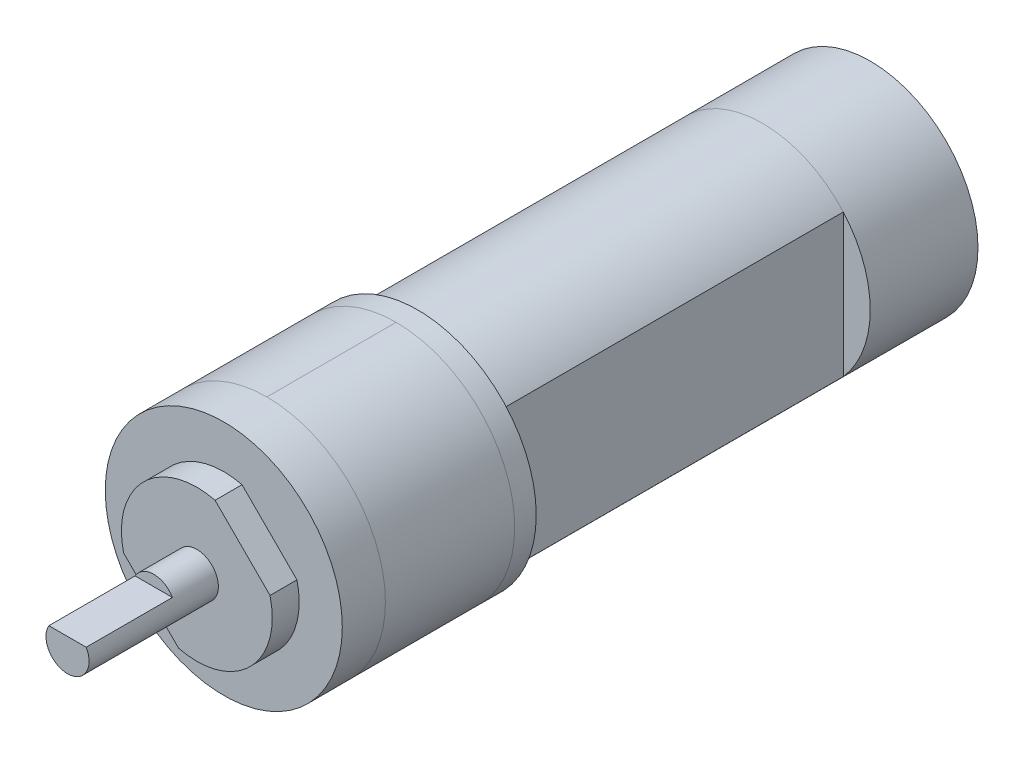
ISO-10303-21;
HEADER;
FILE_DESCRIPTION(('STEP AP214'),'2;1');
FILE_NAME('part.step','',(''),(''),'','','');
FILE_SCHEMA(('AUTOMOTIVE_DESIGN { 1 0 10303 214 1 1 1 1 }'));
ENDSEC;
DATA;
#1=APPLICATION_CONTEXT('core data for automotive mechanical design processes');
#2=APPLICATION_PROTOCOL_DEFINITION('international standard','automotive_design',2000,#1);
#3=PRODUCT_CONTEXT('',#1,'mechanical');
#4=PRODUCT('Part','Part','',(#3));
#5=PRODUCT_RELATED_PRODUCT_CATEGORY('part','',(#4));
#6=PRODUCT_DEFINITION_FORMATION('','',#4);
#7=PRODUCT_DEFINITION_CONTEXT('part definition',#1,'design');
#8=PRODUCT_DEFINITION('design','',#6,#7);
#9=PRODUCT_DEFINITION_SHAPE('','',#8);
#10=(LENGTH_UNIT() NAMED_UNIT(*) SI_UNIT(.MILLI.,.METRE.));
#11=(NAMED_UNIT(*) PLANE_ANGLE_UNIT() SI_UNIT($,.RADIAN.));
#12=(NAMED_UNIT(*) SI_UNIT($,.STERADIAN.) SOLID_ANGLE_UNIT());
#13=UNCERTAINTY_MEASURE_WITH_UNIT(LENGTH_MEASURE(1.E-05),#10,'distance_accuracy_value','');
#14=(GEOMETRIC_REPRESENTATION_CONTEXT(3) GLOBAL_UNCERTAINTY_ASSIGNED_CONTEXT((#13)) GLOBAL_UNIT_ASSIGNED_CONTEXT((#10,
#11,#12)) REPRESENTATION_CONTEXT('',''));
#15=CARTESIAN_POINT('',(0.,0.,0.));
#16=DIRECTION('',(0.,0.,1.));
#17=DIRECTION('',(1.,0.,0.));
#18=AXIS2_PLACEMENT_3D('',#15,#16,#17);
#19=CARTESIAN_POINT('',(0.,0.,51.2955465587045));
#20=DIRECTION('',(0.,0.,1.));
#21=DIRECTION('',(1.,0.,0.));
#22=AXIS2_PLACEMENT_3D('',#19,#20,#21);
#23=CYLINDRICAL_SURFACE('',#22,10.);
#24=CARTESIAN_POINT('',(0.,0.,-32.));
#25=DIRECTION('',(0.,0.,-1.));
#26=DIRECTION('',(-1.,0.,0.));
#27=AXIS2_PLACEMENT_3D('',#24,#25,#26);
#28=CIRCLE('',#27,10.);
#29=CARTESIAN_POINT('',(-7.5,-6.61437827766148,-32.));
#30=VERTEX_POINT('',#29);
#31=CARTESIAN_POINT('',(0.,-10.,-32.));
#32=VERTEX_POINT('',#31);
#33=EDGE_CURVE('E54',#30,#32,#28,.F.);
#34=ORIENTED_EDGE('',*,*,#33,.T.);
#35=CARTESIAN_POINT('',(7.5,-6.61437827766148,-32.));
#36=VERTEX_POINT('',#35);
#37=EDGE_CURVE('E12',#32,#36,#28,.F.);
#38=ORIENTED_EDGE('',*,*,#37,.T.);
#39=DIRECTION('',(0.,0.,1.));
#40=VECTOR('',#39,1.);
#41=CARTESIAN_POINT('',(7.5,-6.61437827766148,51.2955465587045));
#42=LINE('',#41,#40);
#43=CARTESIAN_POINT('',(7.5,-6.61437827766148,0.));
#44=VERTEX_POINT('',#43);
#45=EDGE_CURVE('E184',#36,#44,#42,.T.);
#46=ORIENTED_EDGE('',*,*,#45,.T.);
#47=CARTESIAN_POINT('',(0.,0.,0.));
#48=DIRECTION('',(0.,0.,1.));
#49=DIRECTION('',(1.,0.,0.));
#50=AXIS2_PLACEMENT_3D('',#47,#48,#49);
#51=CIRCLE('',#50,10.);
#52=CARTESIAN_POINT('',(-7.5,-6.61437827766148,0.));
#53=VERTEX_POINT('',#52);
#54=EDGE_CURVE('E213',#53,#44,#51,.T.);
#55=ORIENTED_EDGE('',*,*,#54,.F.);
#56=DIRECTION('',(0.,0.,1.));
#57=VECTOR('',#56,1.);
#58=CARTESIAN_POINT('',(-7.5,-6.61437827766148,51.2955465587045));
#59=LINE('',#58,#57);
#60=EDGE_CURVE('E196',#53,#30,#59,.F.);
#61=ORIENTED_EDGE('',*,*,#60,.T.);
#62=EDGE_LOOP('',(#34,#38,#46,#55,#61));
#63=FACE_BOUND('',#62,.T.);
#64=ADVANCED_FACE('F44',(#63),#23,.T.);
#65=DIRECTION('',(0.,0.,1.));
#66=VECTOR('',#65,1.);
#67=CARTESIAN_POINT('',(7.5,6.61437827766148,51.2955465587045));
#68=LINE('',#67,#66);
#69=CARTESIAN_POINT('',(7.5,6.61437827766148,0.));
#70=VERTEX_POINT('',#69);
#71=CARTESIAN_POINT('',(7.5,6.61437827766148,-32.));
#72=VERTEX_POINT('',#71);
#73=EDGE_CURVE('E191',#70,#72,#68,.F.);
#74=ORIENTED_EDGE('',*,*,#73,.T.);
#75=CARTESIAN_POINT('',(0.,10.,-32.));
#76=VERTEX_POINT('',#75);
#77=EDGE_CURVE('E67',#72,#76,#28,.F.);
#78=ORIENTED_EDGE('',*,*,#77,.T.);
#79=CARTESIAN_POINT('',(-7.5,6.61437827766148,-32.));
#80=VERTEX_POINT('',#79);
#81=EDGE_CURVE('E48',#76,#80,#28,.F.);
#82=ORIENTED_EDGE('',*,*,#81,.T.);
#83=DIRECTION('',(0.,0.,1.));
#84=VECTOR('',#83,1.);
#85=CARTESIAN_POINT('',(-7.5,6.61437827766148,51.2955465587045));
#86=LINE('',#85,#84);
#87=CARTESIAN_POINT('',(-7.5,6.61437827766148,0.));
#88=VERTEX_POINT('',#87);
#89=EDGE_CURVE('E193',#80,#88,#86,.T.);
#90=ORIENTED_EDGE('',*,*,#89,.T.);
#91=EDGE_CURVE('E214',#70,#88,#51,.T.);
#92=ORIENTED_EDGE('',*,*,#91,.F.);
#93=EDGE_LOOP('',(#74,#78,#82,#90,#92));
#94=FACE_BOUND('',#93,.T.);
#95=ADVANCED_FACE('F296',(#94),#23,.T.);
#96=CARTESIAN_POINT('',(0.,0.,51.2955465587045));
#97=DIRECTION('',(0.,0.,1.));
#98=DIRECTION('',(1.,0.,0.));
#99=AXIS2_PLACEMENT_3D('',#96,#97,#98);
#100=CYLINDRICAL_SURFACE('',#99,11.);
#101=DIRECTION('',(0.,0.,1.));
#102=VECTOR('',#101,1.);
#103=CARTESIAN_POINT('',(0.,-11.,51.2955465587045));
#104=LINE('',#103,#102);
#105=CARTESIAN_POINT('',(0.,-11.,2.));
#106=VERTEX_POINT('',#105);
#107=CARTESIAN_POINT('',(0.,-11.,14.));
#108=VERTEX_POINT('',#107);
#109=EDGE_CURVE('E251',#106,#108,#104,.T.);
#110=ORIENTED_EDGE('',*,*,#109,.F.);
#111=CARTESIAN_POINT('',(0.,0.,2.));
#112=DIRECTION('',(0.,0.,1.));
#113=DIRECTION('',(0.,-1.,0.));
#114=AXIS2_PLACEMENT_3D('',#111,#112,#113);
#115=CIRCLE('',#114,11.);
#116=CARTESIAN_POINT('',(0.,11.,2.));
#117=VERTEX_POINT('',#116);
#118=EDGE_CURVE('E246',#106,#117,#115,.T.);
#119=ORIENTED_EDGE('',*,*,#118,.T.);
#120=DIRECTION('',(0.,0.,1.));
#121=VECTOR('',#120,1.);
#122=CARTESIAN_POINT('',(0.,11.,51.2955465587045));
#123=LINE('',#122,#121);
#124=CARTESIAN_POINT('',(0.,11.,14.));
#125=VERTEX_POINT('',#124);
#126=EDGE_CURVE('E238',#117,#125,#123,.T.);
#127=ORIENTED_EDGE('',*,*,#126,.T.);
#128=CARTESIAN_POINT('',(0.,0.,14.));
#129=DIRECTION('',(0.,0.,-1.));
#130=DIRECTION('',(0.,1.,0.));
#131=AXIS2_PLACEMENT_3D('',#128,#129,#130);
#132=CIRCLE('',#131,11.);
#133=EDGE_CURVE('E250',#125,#108,#132,.T.);
#134=ORIENTED_EDGE('',*,*,#133,.T.);
#135=EDGE_LOOP('',(#110,#119,#127,#134));
#136=FACE_BOUND('',#135,.T.);
#137=ADVANCED_FACE('F264',(#136),#100,.T.);
#138=CARTESIAN_POINT('',(0.,0.,18.));
#139=DIRECTION('',(0.,0.,1.));
#140=DIRECTION('',(1.,0.,0.));
#141=AXIS2_PLACEMENT_3D('',#138,#139,#140);
#142=CIRCLE('',#141,11.);
#143=CARTESIAN_POINT('',(11.,0.,18.));
#144=VERTEX_POINT('',#143);
#145=EDGE_CURVE('E207',#144,#144,#142,.T.);
#146=ORIENTED_EDGE('',*,*,#145,.F.);
#147=EDGE_LOOP('',(#146));
#148=FACE_BOUND('',#147,.T.);
#149=ORIENTED_EDGE('',*,*,#133,.F.);
#150=EDGE_CURVE('E247',#108,#125,#132,.T.);
#151=ORIENTED_EDGE('',*,*,#150,.F.);
#152=EDGE_LOOP('',(#149,#151));
#153=FACE_BOUND('',#152,.T.);
#154=ADVANCED_FACE('F268',(#148,#153),#100,.T.);
#155=CARTESIAN_POINT('',(0.,0.,0.));
#156=DIRECTION('',(0.,0.,1.));
#157=DIRECTION('',(1.,0.,0.));
#158=AXIS2_PLACEMENT_3D('',#155,#156,#157);
#159=CIRCLE('',#158,11.);
#160=CARTESIAN_POINT('',(11.,0.,0.));
#161=VERTEX_POINT('',#160);
#162=EDGE_CURVE('E210',#161,#161,#159,.T.);
#163=ORIENTED_EDGE('',*,*,#162,.T.);
#164=EDGE_LOOP('',(#163));
#165=FACE_BOUND('',#164,.T.);
#166=ORIENTED_EDGE('',*,*,#118,.F.);
#167=EDGE_CURVE('E242',#117,#106,#115,.T.);
#168=ORIENTED_EDGE('',*,*,#167,.F.);
#169=EDGE_LOOP('',(#166,#168));
#170=FACE_BOUND('',#169,.T.);
#171=ADVANCED_FACE('F272',(#165,#170),#100,.T.);
#172=CARTESIAN_POINT('',(0.,0.,51.2955465587045));
#173=DIRECTION('',(0.,0.,1.));
#174=DIRECTION('',(1.,0.,0.));
#175=AXIS2_PLACEMENT_3D('',#172,#173,#174);
#176=CYLINDRICAL_SURFACE('',#175,7.);
#177=CARTESIAN_POINT('',(0.,0.,18.));
#178=DIRECTION('',(0.,0.,1.));
#179=DIRECTION('',(1.,0.,0.));
#180=AXIS2_PLACEMENT_3D('',#177,#178,#179);
#181=CIRCLE('',#180,7.);
#182=CARTESIAN_POINT('',(-1.69313093032293,-6.79215044391567,18.));
#183=VERTEX_POINT('',#182);
#184=CARTESIAN_POINT('',(6.79215044391569,1.69313093032286,18.));
#185=VERTEX_POINT('',#184);
#186=EDGE_CURVE('E203',#183,#185,#181,.T.);
#187=ORIENTED_EDGE('',*,*,#186,.T.);
#188=DIRECTION('',(0.,0.,1.));
#189=VECTOR('',#188,1.);
#190=CARTESIAN_POINT('',(6.79215044391569,1.69313093032286,51.2955465587045));
#191=LINE('',#190,#189);
#192=CARTESIAN_POINT('',(6.79215044391569,1.69313093032286,20.5));
#193=VERTEX_POINT('',#192);
#194=EDGE_CURVE('E167',#185,#193,#191,.T.);
#195=ORIENTED_EDGE('',*,*,#194,.T.);
#196=CARTESIAN_POINT('',(0.,0.,20.5));
#197=DIRECTION('',(0.,0.,1.));
#198=DIRECTION('',(1.,0.,0.));
#199=AXIS2_PLACEMENT_3D('',#196,#197,#198);
#200=CIRCLE('',#199,7.);
#201=CARTESIAN_POINT('',(-1.69313093032293,-6.79215044391567,20.5));
#202=VERTEX_POINT('',#201);
#203=EDGE_CURVE('E199',#202,#193,#200,.T.);
#204=ORIENTED_EDGE('',*,*,#203,.F.);
#205=DIRECTION('',(0.,0.,1.));
#206=VECTOR('',#205,1.);
#207=CARTESIAN_POINT('',(-1.69313093032293,-6.79215044391567,51.2955465587045));
#208=LINE('',#207,#206);
#209=EDGE_CURVE('E226',#202,#183,#208,.F.);
#210=ORIENTED_EDGE('',*,*,#209,.T.);
#211=EDGE_LOOP('',(#187,#195,#204,#210));
#212=FACE_BOUND('',#211,.T.);
#213=ADVANCED_FACE('F278',(#212),#176,.T.);
#214=ORIENTED_EDGE('',*,*,#37,.F.);
#215=ORIENTED_EDGE('',*,*,#33,.F.);
#216=CARTESIAN_POINT('',(0.,0.,-32.));
#217=DIRECTION('',(0.,0.,-1.));
#218=DIRECTION('',(-1.,0.,0.));
#219=AXIS2_PLACEMENT_3D('',#216,#217,#218);
#220=CIRCLE('',#219,10.);
#221=EDGE_CURVE('E223',#80,#30,#220,.F.);
#222=ORIENTED_EDGE('',*,*,#221,.F.);
#223=ORIENTED_EDGE('',*,*,#81,.F.);
#224=ORIENTED_EDGE('',*,*,#77,.F.);
#225=CARTESIAN_POINT('',(0.,0.,-32.));
#226=DIRECTION('',(0.,0.,-1.));
#227=DIRECTION('',(-1.,0.,0.));
#228=AXIS2_PLACEMENT_3D('',#225,#226,#227);
#229=CIRCLE('',#228,10.);
#230=EDGE_CURVE('E220',#36,#72,#229,.F.);
#231=ORIENTED_EDGE('',*,*,#230,.F.);
#232=EDGE_LOOP('',(#214,#215,#222,#223,#224,#231));
#233=FACE_BOUND('',#232,.T.);
#234=CARTESIAN_POINT('',(0.,0.,-42.));
#235=DIRECTION('',(0.,0.,1.));
#236=DIRECTION('',(1.,0.,0.));
#237=AXIS2_PLACEMENT_3D('',#234,#235,#236);
#238=CIRCLE('',#237,10.);
#239=CARTESIAN_POINT('',(10.,0.,-42.));
#240=VERTEX_POINT('',#239);
#241=EDGE_CURVE('E217',#240,#240,#238,.T.);
#242=ORIENTED_EDGE('',*,*,#241,.T.);
#243=EDGE_LOOP('',(#242));
#244=FACE_BOUND('',#243,.T.);
#245=ADVANCED_FACE('F285',(#233,#244),#23,.T.);
#246=CARTESIAN_POINT('',(0.,0.,20.5));
#247=DIRECTION('',(0.,0.,-1.));
#248=DIRECTION('',(-1.,0.,0.));
#249=AXIS2_PLACEMENT_3D('',#246,#247,#248);
#250=PLANE('',#249);
#251=CARTESIAN_POINT('',(0.,0.,20.5));
#252=DIRECTION('',(0.,0.,1.));
#253=DIRECTION('',(1.,0.,0.));
#254=AXIS2_PLACEMENT_3D('',#251,#252,#253);
#255=CIRCLE('',#254,2.);
#256=CARTESIAN_POINT('',(2.,0.,20.5));
#257=VERTEX_POINT('',#256);
#258=EDGE_CURVE('E150',#257,#257,#255,.T.);
#259=ORIENTED_EDGE('',*,*,#258,.F.);
#260=EDGE_LOOP('',(#259));
#261=FACE_BOUND('',#260,.T.);
#262=ORIENTED_EDGE('',*,*,#203,.T.);
#263=DIRECTION('',(0.707106781186544,-0.707106781186551,0.));
#264=VECTOR('',#263,1.);
#265=CARTESIAN_POINT('',(-0.7071067811865,9.19238815542512,20.5));
#266=LINE('',#265,#264);
#267=CARTESIAN_POINT('',(1.69313093032293,6.79215044391567,20.5));
#268=VERTEX_POINT('',#267);
#269=EDGE_CURVE('E160',#268,#193,#266,.T.);
#270=ORIENTED_EDGE('',*,*,#269,.F.);
#271=CARTESIAN_POINT('',(-6.79215044391569,-1.69313093032285,20.5));
#272=VERTEX_POINT('',#271);
#273=EDGE_CURVE('E202',#268,#272,#200,.T.);
#274=ORIENTED_EDGE('',*,*,#273,.T.);
#275=DIRECTION('',(-0.707106781186544,0.707106781186551,0.));
#276=VECTOR('',#275,1.);
#277=CARTESIAN_POINT('',(-9.19238815542511,0.707106781186597,20.5));
#278=LINE('',#277,#276);
#279=EDGE_CURVE('E171',#202,#272,#278,.T.);
#280=ORIENTED_EDGE('',*,*,#279,.F.);
#281=EDGE_LOOP('',(#262,#270,#274,#280));
#282=FACE_BOUND('',#281,.T.);
#283=ADVANCED_FACE('F46',(#261,#282),#250,.F.);
#284=CARTESIAN_POINT('',(0.,0.,-42.));
#285=DIRECTION('',(0.,0.,-1.));
#286=DIRECTION('',(-1.,0.,0.));
#287=AXIS2_PLACEMENT_3D('',#284,#285,#286);
#288=PLANE('',#287);
#289=ORIENTED_EDGE('',*,*,#241,.F.);
#290=EDGE_LOOP('',(#289));
#291=FACE_BOUND('',#290,.T.);
#292=ADVANCED_FACE('F306',(#291),#288,.T.);
#293=CARTESIAN_POINT('',(0.,0.,0.));
#294=DIRECTION('',(0.,0.,1.));
#295=DIRECTION('',(1.,0.,0.));
#296=AXIS2_PLACEMENT_3D('',#293,#294,#295);
#297=PLANE('',#296);
#298=ORIENTED_EDGE('',*,*,#91,.T.);
#299=DIRECTION('',(0.,-1.,0.));
#300=VECTOR('',#299,1.);
#301=CARTESIAN_POINT('',(-7.5,11.,0.));
#302=LINE('',#301,#300);
#303=EDGE_CURVE('E177',#88,#53,#302,.T.);
#304=ORIENTED_EDGE('',*,*,#303,.T.);
#305=ORIENTED_EDGE('',*,*,#54,.T.);
#306=DIRECTION('',(0.,1.,0.));
#307=VECTOR('',#306,1.);
#308=CARTESIAN_POINT('',(7.5,11.,0.));
#309=LINE('',#308,#307);
#310=EDGE_CURVE('E176',#44,#70,#309,.T.);
#311=ORIENTED_EDGE('',*,*,#310,.T.);
#312=EDGE_LOOP('',(#298,#304,#305,#311));
#313=FACE_BOUND('',#312,.T.);
#314=ORIENTED_EDGE('',*,*,#162,.F.);
#315=EDGE_LOOP('',(#314));
#316=FACE_BOUND('',#315,.T.);
#317=ADVANCED_FACE('F294',(#313,#316),#297,.F.);
#318=ORIENTED_EDGE('',*,*,#167,.T.);
#319=ORIENTED_EDGE('',*,*,#109,.T.);
#320=ORIENTED_EDGE('',*,*,#150,.T.);
#321=ORIENTED_EDGE('',*,*,#126,.F.);
#322=EDGE_LOOP('',(#318,#319,#320,#321));
#323=FACE_BOUND('',#322,.T.);
#324=ADVANCED_FACE('F269',(#323),#100,.T.);
#325=CARTESIAN_POINT('',(0.,0.,18.));
#326=DIRECTION('',(0.,0.,-1.));
#327=DIRECTION('',(-1.,0.,0.));
#328=AXIS2_PLACEMENT_3D('',#325,#326,#327);
#329=PLANE('',#328);
#330=DIRECTION('',(0.707106781186544,-0.707106781186551,0.));
#331=VECTOR('',#330,1.);
#332=CARTESIAN_POINT('',(-0.7071067811865,9.19238815542512,18.));
#333=LINE('',#332,#331);
#334=CARTESIAN_POINT('',(1.69313093032293,6.79215044391567,18.));
#335=VERTEX_POINT('',#334);
#336=EDGE_CURVE('E162',#335,#185,#333,.T.);
#337=ORIENTED_EDGE('',*,*,#336,.T.);
#338=ORIENTED_EDGE('',*,*,#186,.F.);
#339=DIRECTION('',(-0.707106781186544,0.707106781186551,0.));
#340=VECTOR('',#339,1.);
#341=CARTESIAN_POINT('',(-9.19238815542511,0.707106781186597,18.));
#342=LINE('',#341,#340);
#343=CARTESIAN_POINT('',(-6.79215044391569,-1.69313093032285,18.));
#344=VERTEX_POINT('',#343);
#345=EDGE_CURVE('E173',#183,#344,#342,.T.);
#346=ORIENTED_EDGE('',*,*,#345,.T.);
#347=EDGE_CURVE('E206',#335,#344,#181,.T.);
#348=ORIENTED_EDGE('',*,*,#347,.F.);
#349=EDGE_LOOP('',(#337,#338,#346,#348));
#350=FACE_BOUND('',#349,.T.);
#351=ORIENTED_EDGE('',*,*,#145,.T.);
#352=EDGE_LOOP('',(#351));
#353=FACE_BOUND('',#352,.T.);
#354=ADVANCED_FACE('F293',(#350,#353),#329,.F.);
#355=ORIENTED_EDGE('',*,*,#273,.F.);
#356=DIRECTION('',(0.,0.,1.));
#357=VECTOR('',#356,1.);
#358=CARTESIAN_POINT('',(1.69313093032293,6.79215044391567,51.2955465587045));
#359=LINE('',#358,#357);
#360=EDGE_CURVE('E232',#268,#335,#359,.F.);
#361=ORIENTED_EDGE('',*,*,#360,.T.);
#362=ORIENTED_EDGE('',*,*,#347,.T.);
#363=DIRECTION('',(0.,0.,1.));
#364=VECTOR('',#363,1.);
#365=CARTESIAN_POINT('',(-6.79215044391569,-1.69313093032285,51.2955465587045));
#366=LINE('',#365,#364);
#367=EDGE_CURVE('E229',#344,#272,#366,.T.);
#368=ORIENTED_EDGE('',*,*,#367,.T.);
#369=EDGE_LOOP('',(#355,#361,#362,#368));
#370=FACE_BOUND('',#369,.T.);
#371=ADVANCED_FACE('F288',(#370),#176,.T.);
#372=CARTESIAN_POINT('',(7.5,11.,-64.2766694099455));
#373=DIRECTION('',(1.,0.,0.));
#374=DIRECTION('',(0.,0.,-1.));
#375=AXIS2_PLACEMENT_3D('',#372,#373,#374);
#376=PLANE('',#375);
#377=ORIENTED_EDGE('',*,*,#310,.F.);
#378=ORIENTED_EDGE('',*,*,#45,.F.);
#379=DIRECTION('',(0.,1.,0.));
#380=VECTOR('',#379,1.);
#381=CARTESIAN_POINT('',(7.5,11.,-32.));
#382=LINE('',#381,#380);
#383=EDGE_CURVE('E181',#36,#72,#382,.T.);
#384=ORIENTED_EDGE('',*,*,#383,.T.);
#385=ORIENTED_EDGE('',*,*,#73,.F.);
#386=EDGE_LOOP('',(#377,#378,#384,#385));
#387=FACE_BOUND('',#386,.T.);
#388=ADVANCED_FACE('F343',(#387),#376,.T.);
#389=CARTESIAN_POINT('',(0.,0.,-32.));
#390=DIRECTION('',(0.,0.,-1.));
#391=DIRECTION('',(-1.,0.,0.));
#392=AXIS2_PLACEMENT_3D('',#389,#390,#391);
#393=PLANE('',#392);
#394=ORIENTED_EDGE('',*,*,#230,.T.);
#395=ORIENTED_EDGE('',*,*,#383,.F.);
#396=EDGE_LOOP('',(#394,#395));
#397=FACE_BOUND('',#396,.T.);
#398=ADVANCED_FACE('F340',(#397),#393,.F.);
#399=CARTESIAN_POINT('',(-7.5,11.,-64.2766694099455));
#400=DIRECTION('',(-1.,0.,0.));
#401=DIRECTION('',(0.,0.,1.));
#402=AXIS2_PLACEMENT_3D('',#399,#400,#401);
#403=PLANE('',#402);
#404=ORIENTED_EDGE('',*,*,#303,.F.);
#405=ORIENTED_EDGE('',*,*,#89,.F.);
#406=DIRECTION('',(0.,-1.,0.));
#407=VECTOR('',#406,1.);
#408=CARTESIAN_POINT('',(-7.5,11.,-32.));
#409=LINE('',#408,#407);
#410=EDGE_CURVE('E180',#80,#30,#409,.T.);
#411=ORIENTED_EDGE('',*,*,#410,.T.);
#412=ORIENTED_EDGE('',*,*,#60,.F.);
#413=EDGE_LOOP('',(#404,#405,#411,#412));
#414=FACE_BOUND('',#413,.T.);
#415=ADVANCED_FACE('F327',(#414),#403,.T.);
#416=CARTESIAN_POINT('',(0.,0.,-32.));
#417=DIRECTION('',(0.,0.,-1.));
#418=DIRECTION('',(-1.,0.,0.));
#419=AXIS2_PLACEMENT_3D('',#416,#417,#418);
#420=PLANE('',#419);
#421=ORIENTED_EDGE('',*,*,#221,.T.);
#422=ORIENTED_EDGE('',*,*,#410,.F.);
#423=EDGE_LOOP('',(#421,#422));
#424=FACE_BOUND('',#423,.T.);
#425=ADVANCED_FACE('F329',(#424),#420,.F.);
#426=CARTESIAN_POINT('',(-9.19238815542511,0.707106781186597,-1.));
#427=DIRECTION('',(0.707106781186551,0.707106781186544,0.));
#428=DIRECTION('',(-0.707106781186544,0.707106781186551,0.));
#429=AXIS2_PLACEMENT_3D('',#426,#427,#428);
#430=PLANE('',#429);
#431=ORIENTED_EDGE('',*,*,#345,.F.);
#432=ORIENTED_EDGE('',*,*,#209,.F.);
#433=ORIENTED_EDGE('',*,*,#279,.T.);
#434=ORIENTED_EDGE('',*,*,#367,.F.);
#435=EDGE_LOOP('',(#431,#432,#433,#434));
#436=FACE_BOUND('',#435,.T.);
#437=ADVANCED_FACE('F331',(#436),#430,.F.);
#438=CARTESIAN_POINT('',(-0.7071067811865,9.19238815542512,-1.));
#439=DIRECTION('',(-0.707106781186551,-0.707106781186544,0.));
#440=DIRECTION('',(0.707106781186544,-0.707106781186551,0.));
#441=AXIS2_PLACEMENT_3D('',#438,#439,#440);
#442=PLANE('',#441);
#443=ORIENTED_EDGE('',*,*,#336,.F.);
#444=ORIENTED_EDGE('',*,*,#360,.F.);
#445=ORIENTED_EDGE('',*,*,#269,.T.);
#446=ORIENTED_EDGE('',*,*,#194,.F.);
#447=EDGE_LOOP('',(#443,#444,#445,#446));
#448=FACE_BOUND('',#447,.T.);
#449=ADVANCED_FACE('F337',(#448),#442,.F.);
#450=CARTESIAN_POINT('',(0.,0.,32.5));
#451=DIRECTION('',(0.,0.,-1.));
#452=DIRECTION('',(-1.,0.,0.));
#453=AXIS2_PLACEMENT_3D('',#450,#451,#452);
#454=CYLINDRICAL_SURFACE('',#453,2.);
#455=CARTESIAN_POINT('',(0.,0.,32.5));
#456=DIRECTION('',(0.,0.,1.));
#457=DIRECTION('',(1.,0.,0.));
#458=AXIS2_PLACEMENT_3D('',#455,#456,#457);
#459=CIRCLE('',#458,2.);
#460=CARTESIAN_POINT('',(-1.73205080756888,1.,32.5));
#461=VERTEX_POINT('',#460);
#462=CARTESIAN_POINT('',(1.73205080756888,1.,32.5));
#463=VERTEX_POINT('',#462);
#464=EDGE_CURVE('E156',#461,#463,#459,.T.);
#465=ORIENTED_EDGE('',*,*,#464,.F.);
#466=DIRECTION('',(0.,0.,-1.));
#467=VECTOR('',#466,1.);
#468=CARTESIAN_POINT('',(-1.73205080756888,1.,32.5));
#469=LINE('',#468,#467);
#470=CARTESIAN_POINT('',(-1.73205080756888,1.,24.5));
#471=VERTEX_POINT('',#470);
#472=EDGE_CURVE('E145',#461,#471,#469,.T.);
#473=ORIENTED_EDGE('',*,*,#472,.T.);
#474=CARTESIAN_POINT('',(0.,0.,24.5));
#475=DIRECTION('',(0.,0.,-1.));
#476=DIRECTION('',(-1.,0.,0.));
#477=AXIS2_PLACEMENT_3D('',#474,#475,#476);
#478=CIRCLE('',#477,2.);
#479=CARTESIAN_POINT('',(1.73205080756888,1.,24.5));
#480=VERTEX_POINT('',#479);
#481=EDGE_CURVE('E149',#471,#480,#478,.T.);
#482=ORIENTED_EDGE('',*,*,#481,.T.);
#483=DIRECTION('',(0.,0.,-1.));
#484=VECTOR('',#483,1.);
#485=CARTESIAN_POINT('',(1.73205080756888,1.,32.5));
#486=LINE('',#485,#484);
#487=EDGE_CURVE('E142',#480,#463,#486,.F.);
#488=ORIENTED_EDGE('',*,*,#487,.T.);
#489=EDGE_LOOP('',(#465,#473,#482,#488));
#490=FACE_BOUND('',#489,.T.);
#491=ORIENTED_EDGE('',*,*,#258,.T.);
#492=EDGE_LOOP('',(#491));
#493=FACE_BOUND('',#492,.T.);
#494=ADVANCED_FACE('F154',(#490,#493),#454,.T.);
#495=CARTESIAN_POINT('',(0.,0.,32.5));
#496=DIRECTION('',(0.,0.,1.));
#497=DIRECTION('',(1.,0.,0.));
#498=AXIS2_PLACEMENT_3D('',#495,#496,#497);
#499=PLANE('',#498);
#500=DIRECTION('',(1.,0.,0.));
#501=VECTOR('',#500,1.);
#502=CARTESIAN_POINT('',(0.,1.,32.5));
#503=LINE('',#502,#501);
#504=EDGE_CURVE('E138',#461,#463,#503,.T.);
#505=ORIENTED_EDGE('',*,*,#504,.F.);
#506=ORIENTED_EDGE('',*,*,#464,.T.);
#507=EDGE_LOOP('',(#505,#506));
#508=FACE_BOUND('',#507,.T.);
#509=ADVANCED_FACE('F159',(#508),#499,.T.);
#510=CARTESIAN_POINT('',(0.,0.,24.5));
#511=DIRECTION('',(0.,0.,-1.));
#512=DIRECTION('',(-1.,0.,0.));
#513=AXIS2_PLACEMENT_3D('',#510,#511,#512);
#514=PLANE('',#513);
#515=DIRECTION('',(1.,0.,0.));
#516=VECTOR('',#515,1.);
#517=CARTESIAN_POINT('',(-2.,1.,24.5));
#518=LINE('',#517,#516);
#519=EDGE_CURVE('E157',#471,#480,#518,.T.);
#520=ORIENTED_EDGE('',*,*,#519,.T.);
#521=ORIENTED_EDGE('',*,*,#481,.F.);
#522=EDGE_LOOP('',(#520,#521));
#523=FACE_BOUND('',#522,.T.);
#524=ADVANCED_FACE('F376',(#523),#514,.F.);
#525=CARTESIAN_POINT('',(-2.,1.,24.5));
#526=DIRECTION('',(0.,-1.,0.));
#527=DIRECTION('',(0.,0.,-1.));
#528=AXIS2_PLACEMENT_3D('',#525,#526,#527);
#529=PLANE('',#528);
#530=ORIENTED_EDGE('',*,*,#504,.T.);
#531=ORIENTED_EDGE('',*,*,#487,.F.);
#532=ORIENTED_EDGE('',*,*,#519,.F.);
#533=ORIENTED_EDGE('',*,*,#472,.F.);
#534=EDGE_LOOP('',(#530,#531,#532,#533));
#535=FACE_BOUND('',#534,.T.);
#536=ADVANCED_FACE('F140',(#535),#529,.F.);
#537=CLOSED_SHELL('',(#64,#95,#137,#154,#171,#213,#245,#283,#292,#317,#324,#354,#371,#388,#398,
#415,#425,#437,#449,#494,#509,#524,#536));
#538=MANIFOLD_SOLID_BREP('B2',#537);
#539=ADVANCED_BREP_SHAPE_REPRESENTATION('',(#18,#538),#14);
#540=SHAPE_DEFINITION_REPRESENTATION(#9,#539);
ENDSEC;
END-ISO-10303-21;
